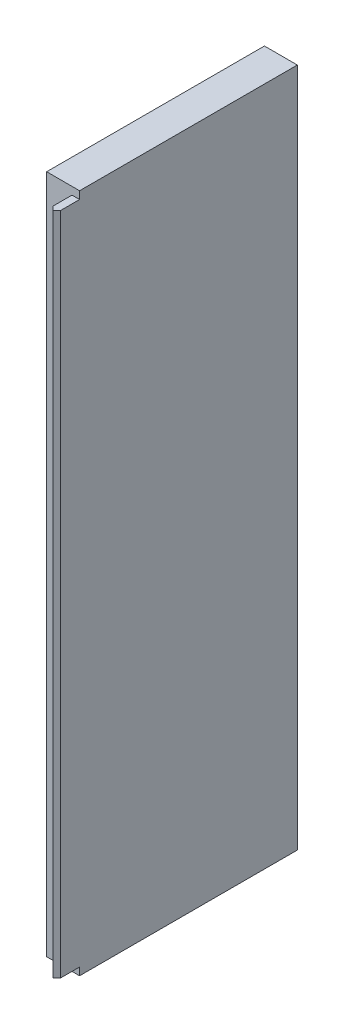
ISO-10303-21;
HEADER;
FILE_DESCRIPTION(('STEP AP214'),'2;1');
FILE_NAME('part.step','',(''),(''),'','','');
FILE_SCHEMA(('AUTOMOTIVE_DESIGN { 1 0 10303 214 1 1 1 1 }'));
ENDSEC;
DATA;
#1=APPLICATION_CONTEXT('core data for automotive mechanical design processes');
#2=APPLICATION_PROTOCOL_DEFINITION('international standard','automotive_design',2000,#1);
#3=PRODUCT_CONTEXT('',#1,'mechanical');
#4=PRODUCT('Part','Part','',(#3));
#5=PRODUCT_RELATED_PRODUCT_CATEGORY('part','',(#4));
#6=PRODUCT_DEFINITION_FORMATION('','',#4);
#7=PRODUCT_DEFINITION_CONTEXT('part definition',#1,'design');
#8=PRODUCT_DEFINITION('design','',#6,#7);
#9=PRODUCT_DEFINITION_SHAPE('','',#8);
#10=(LENGTH_UNIT() NAMED_UNIT(*) SI_UNIT(.MILLI.,.METRE.));
#11=(NAMED_UNIT(*) PLANE_ANGLE_UNIT() SI_UNIT($,.RADIAN.));
#12=(NAMED_UNIT(*) SI_UNIT($,.STERADIAN.) SOLID_ANGLE_UNIT());
#13=UNCERTAINTY_MEASURE_WITH_UNIT(LENGTH_MEASURE(1.E-05),#10,'distance_accuracy_value','');
#14=(GEOMETRIC_REPRESENTATION_CONTEXT(3) GLOBAL_UNCERTAINTY_ASSIGNED_CONTEXT((#13)) GLOBAL_UNIT_ASSIGNED_CONTEXT((#10,
#11,#12)) REPRESENTATION_CONTEXT('',''));
#15=CARTESIAN_POINT('',(0.,0.,0.));
#16=DIRECTION('',(0.,0.,1.));
#17=DIRECTION('',(1.,0.,0.));
#18=AXIS2_PLACEMENT_3D('',#15,#16,#17);
#19=CARTESIAN_POINT('',(0.,0.,0.));
#20=DIRECTION('',(0.,1.,0.));
#21=DIRECTION('',(0.,0.,1.));
#22=AXIS2_PLACEMENT_3D('',#19,#20,#21);
#23=PLANE('',#22);
#24=DIRECTION('',(0.707106781186554,0.,-0.707106781186541));
#25=VECTOR('',#24,1.);
#26=CARTESIAN_POINT('',(1.2,0.,20.2));
#27=LINE('',#26,#25);
#28=CARTESIAN_POINT('',(1.2,0.,20.2));
#29=VERTEX_POINT('',#28);
#30=CARTESIAN_POINT('',(0.600000000000002,0.,20.8));
#31=VERTEX_POINT('',#30);
#32=EDGE_CURVE('E388',#29,#31,#27,.F.);
#33=ORIENTED_EDGE('',*,*,#32,.T.);
#34=DIRECTION('',(0.707106781186543,0.,0.707106781186552));
#35=VECTOR('',#34,1.);
#36=CARTESIAN_POINT('',(0.999999999999987,0.,21.2));
#37=LINE('',#36,#35);
#38=CARTESIAN_POINT('',(0.,0.,20.2));
#39=VERTEX_POINT('',#38);
#40=EDGE_CURVE('E441',#31,#39,#37,.F.);
#41=ORIENTED_EDGE('',*,*,#40,.T.);
#42=DIRECTION('',(0.,0.,1.));
#43=VECTOR('',#42,1.);
#44=CARTESIAN_POINT('',(0.,0.,21.2));
#45=LINE('',#44,#43);
#46=CARTESIAN_POINT('',(0.,0.,17.2));
#47=VERTEX_POINT('',#46);
#48=EDGE_CURVE('E392',#47,#39,#45,.T.);
#49=ORIENTED_EDGE('',*,*,#48,.F.);
#50=DIRECTION('',(-1.,0.,0.));
#51=VECTOR('',#50,1.);
#52=CARTESIAN_POINT('',(1.2,0.,17.2));
#53=LINE('',#52,#51);
#54=CARTESIAN_POINT('',(1.2,0.,17.2));
#55=VERTEX_POINT('',#54);
#56=EDGE_CURVE('E231',#55,#47,#53,.T.);
#57=ORIENTED_EDGE('',*,*,#56,.F.);
#58=DIRECTION('',(0.,0.,-1.));
#59=VECTOR('',#58,1.);
#60=CARTESIAN_POINT('',(1.2,0.,-17.2));
#61=LINE('',#60,#59);
#62=EDGE_CURVE('E410',#29,#55,#61,.T.);
#63=ORIENTED_EDGE('',*,*,#62,.F.);
#64=EDGE_LOOP('',(#33,#41,#49,#57,#63));
#65=FACE_BOUND('',#64,.T.);
#66=ADVANCED_FACE('F33',(#65),#23,.F.);
#67=CARTESIAN_POINT('',(0.,105.,21.2));
#68=DIRECTION('',(1.,0.,0.));
#69=DIRECTION('',(0.,0.,-1.));
#70=AXIS2_PLACEMENT_3D('',#67,#68,#69);
#71=PLANE('',#70);
#72=ORIENTED_EDGE('',*,*,#48,.T.);
#73=DIRECTION('',(0.,1.,0.));
#74=VECTOR('',#73,1.);
#75=CARTESIAN_POINT('',(0.,105.,20.2));
#76=LINE('',#75,#74);
#77=CARTESIAN_POINT('',(0.,105.,20.2));
#78=VERTEX_POINT('',#77);
#79=EDGE_CURVE('E443',#39,#78,#76,.T.);
#80=ORIENTED_EDGE('',*,*,#79,.T.);
#81=DIRECTION('',(0.,0.,1.));
#82=VECTOR('',#81,1.);
#83=CARTESIAN_POINT('',(0.,105.,21.2));
#84=LINE('',#83,#82);
#85=CARTESIAN_POINT('',(0.,105.,17.2));
#86=VERTEX_POINT('',#85);
#87=EDGE_CURVE('E393',#86,#78,#84,.T.);
#88=ORIENTED_EDGE('',*,*,#87,.F.);
#89=DIRECTION('',(0.,-1.,0.));
#90=VECTOR('',#89,1.);
#91=CARTESIAN_POINT('',(0.,105.,17.2));
#92=LINE('',#91,#90);
#93=EDGE_CURVE('E407',#86,#47,#92,.T.);
#94=ORIENTED_EDGE('',*,*,#93,.T.);
#95=EDGE_LOOP('',(#72,#80,#88,#94));
#96=FACE_BOUND('',#95,.T.);
#97=ADVANCED_FACE('F450',(#96),#71,.F.);
#98=CARTESIAN_POINT('',(1.2,105.,-17.2));
#99=DIRECTION('',(-1.,0.,0.));
#100=DIRECTION('',(0.,0.,1.));
#101=AXIS2_PLACEMENT_3D('',#98,#99,#100);
#102=PLANE('',#101);
#103=DIRECTION('',(0.,0.,-1.));
#104=VECTOR('',#103,1.);
#105=CARTESIAN_POINT('',(1.2,105.,17.2));
#106=LINE('',#105,#104);
#107=CARTESIAN_POINT('',(1.2,105.,20.2));
#108=VERTEX_POINT('',#107);
#109=CARTESIAN_POINT('',(1.2,105.,17.2));
#110=VERTEX_POINT('',#109);
#111=EDGE_CURVE('E395',#108,#110,#106,.T.);
#112=ORIENTED_EDGE('',*,*,#111,.F.);
#113=DIRECTION('',(0.,-1.,0.));
#114=VECTOR('',#113,1.);
#115=CARTESIAN_POINT('',(1.2,105.,20.2));
#116=LINE('',#115,#114);
#117=EDGE_CURVE('E11',#108,#29,#116,.T.);
#118=ORIENTED_EDGE('',*,*,#117,.T.);
#119=ORIENTED_EDGE('',*,*,#62,.T.);
#120=DIRECTION('',(0.,1.,0.));
#121=VECTOR('',#120,1.);
#122=CARTESIAN_POINT('',(1.2,-1.2,17.2));
#123=LINE('',#122,#121);
#124=CARTESIAN_POINT('',(1.2,-1.2,17.2));
#125=VERTEX_POINT('',#124);
#126=EDGE_CURVE('E364',#125,#55,#123,.T.);
#127=ORIENTED_EDGE('',*,*,#126,.F.);
#128=DIRECTION('',(0.,0.,1.));
#129=VECTOR('',#128,1.);
#130=CARTESIAN_POINT('',(1.2,-1.2,-17.2));
#131=LINE('',#130,#129);
#132=CARTESIAN_POINT('',(1.2,-1.2,-17.2));
#133=VERTEX_POINT('',#132);
#134=EDGE_CURVE('E351',#133,#125,#131,.T.);
#135=ORIENTED_EDGE('',*,*,#134,.F.);
#136=DIRECTION('',(0.,-1.,0.));
#137=VECTOR('',#136,1.);
#138=CARTESIAN_POINT('',(1.2,105.,-17.2));
#139=LINE('',#138,#137);
#140=CARTESIAN_POINT('',(1.2,106.2,-17.2));
#141=VERTEX_POINT('',#140);
#142=EDGE_CURVE('E389',#141,#133,#139,.T.);
#143=ORIENTED_EDGE('',*,*,#142,.F.);
#144=DIRECTION('',(0.,0.,-1.));
#145=VECTOR('',#144,1.);
#146=CARTESIAN_POINT('',(1.2,106.2,-17.2));
#147=LINE('',#146,#145);
#148=CARTESIAN_POINT('',(1.2,106.2,17.2));
#149=VERTEX_POINT('',#148);
#150=EDGE_CURVE('E371',#149,#141,#147,.T.);
#151=ORIENTED_EDGE('',*,*,#150,.F.);
#152=DIRECTION('',(0.,-1.,0.));
#153=VECTOR('',#152,1.);
#154=CARTESIAN_POINT('',(1.2,106.2,17.2));
#155=LINE('',#154,#153);
#156=EDGE_CURVE('E382',#149,#110,#155,.T.);
#157=ORIENTED_EDGE('',*,*,#156,.T.);
#158=EDGE_LOOP('',(#112,#118,#119,#127,#135,#143,#151,#157));
#159=FACE_BOUND('',#158,.T.);
#160=ADVANCED_FACE('F469',(#159),#102,.F.);
#161=CARTESIAN_POINT('',(-4.00000000000001,105.,-17.2));
#162=DIRECTION('',(0.,0.,1.));
#163=DIRECTION('',(1.,0.,0.));
#164=AXIS2_PLACEMENT_3D('',#161,#162,#163);
#165=PLANE('',#164);
#166=ORIENTED_EDGE('',*,*,#142,.T.);
#167=DIRECTION('',(1.,0.,0.));
#168=VECTOR('',#167,1.);
#169=CARTESIAN_POINT('',(1.2,-1.2,-17.2));
#170=LINE('',#169,#168);
#171=CARTESIAN_POINT('',(-4.,-1.2,-17.2));
#172=VERTEX_POINT('',#171);
#173=EDGE_CURVE('E361',#172,#133,#170,.T.);
#174=ORIENTED_EDGE('',*,*,#173,.F.);
#175=DIRECTION('',(0.,-1.,0.));
#176=VECTOR('',#175,1.);
#177=CARTESIAN_POINT('',(-4.00000000000001,105.,-17.2));
#178=LINE('',#177,#176);
#179=CARTESIAN_POINT('',(-4.00000000000001,106.2,-17.2));
#180=VERTEX_POINT('',#179);
#181=EDGE_CURVE('E437',#180,#172,#178,.T.);
#182=ORIENTED_EDGE('',*,*,#181,.F.);
#183=DIRECTION('',(-1.,0.,0.));
#184=VECTOR('',#183,1.);
#185=CARTESIAN_POINT('',(1.2,106.2,-17.2));
#186=LINE('',#185,#184);
#187=EDGE_CURVE('E374',#141,#180,#186,.T.);
#188=ORIENTED_EDGE('',*,*,#187,.F.);
#189=EDGE_LOOP('',(#166,#174,#182,#188));
#190=FACE_BOUND('',#189,.T.);
#191=ADVANCED_FACE('F485',(#190),#165,.F.);
#192=CARTESIAN_POINT('',(0.,105.,-16.));
#193=DIRECTION('',(0.,0.,-1.));
#194=DIRECTION('',(-1.,0.,0.));
#195=AXIS2_PLACEMENT_3D('',#192,#193,#194);
#196=PLANE('',#195);
#197=DIRECTION('',(1.,0.,0.));
#198=VECTOR('',#197,1.);
#199=CARTESIAN_POINT('',(0.,0.,-16.));
#200=LINE('',#199,#198);
#201=CARTESIAN_POINT('',(-4.,0.,-16.));
#202=VERTEX_POINT('',#201);
#203=CARTESIAN_POINT('',(0.,0.,-16.));
#204=VERTEX_POINT('',#203);
#205=EDGE_CURVE('E412',#202,#204,#200,.T.);
#206=ORIENTED_EDGE('',*,*,#205,.T.);
#207=DIRECTION('',(0.,-1.,0.));
#208=VECTOR('',#207,1.);
#209=CARTESIAN_POINT('',(0.,105.,-16.));
#210=LINE('',#209,#208);
#211=CARTESIAN_POINT('',(0.,105.,-16.));
#212=VERTEX_POINT('',#211);
#213=EDGE_CURVE('E431',#212,#204,#210,.T.);
#214=ORIENTED_EDGE('',*,*,#213,.F.);
#215=DIRECTION('',(1.,0.,0.));
#216=VECTOR('',#215,1.);
#217=CARTESIAN_POINT('',(0.,105.,-16.));
#218=LINE('',#217,#216);
#219=CARTESIAN_POINT('',(-4.,105.,-16.));
#220=VERTEX_POINT('',#219);
#221=EDGE_CURVE('E398',#220,#212,#218,.T.);
#222=ORIENTED_EDGE('',*,*,#221,.F.);
#223=DIRECTION('',(0.,-1.,0.));
#224=VECTOR('',#223,1.);
#225=CARTESIAN_POINT('',(-4.,105.,-16.));
#226=LINE('',#225,#224);
#227=EDGE_CURVE('E434',#220,#202,#226,.T.);
#228=ORIENTED_EDGE('',*,*,#227,.T.);
#229=EDGE_LOOP('',(#206,#214,#222,#228));
#230=FACE_BOUND('',#229,.T.);
#231=ADVANCED_FACE('F487',(#230),#196,.F.);
#232=CARTESIAN_POINT('',(0.,105.,16.));
#233=DIRECTION('',(1.,0.,0.));
#234=DIRECTION('',(0.,0.,-1.));
#235=AXIS2_PLACEMENT_3D('',#232,#233,#234);
#236=PLANE('',#235);
#237=DIRECTION('',(0.,0.,1.));
#238=VECTOR('',#237,1.);
#239=CARTESIAN_POINT('',(0.,0.,16.));
#240=LINE('',#239,#238);
#241=CARTESIAN_POINT('',(0.,0.,-12.5));
#242=VERTEX_POINT('',#241);
#243=EDGE_CURVE('E416',#204,#242,#240,.T.);
#244=ORIENTED_EDGE('',*,*,#243,.T.);
#245=DIRECTION('',(0.,1.,0.));
#246=VECTOR('',#245,1.);
#247=CARTESIAN_POINT('',(0.,-1.201,-12.5));
#248=LINE('',#247,#246);
#249=CARTESIAN_POINT('',(0.,-1.2,-12.5));
#250=VERTEX_POINT('',#249);
#251=EDGE_CURVE('E341',#250,#242,#248,.T.);
#252=ORIENTED_EDGE('',*,*,#251,.F.);
#253=DIRECTION('',(0.,0.,-1.));
#254=VECTOR('',#253,1.);
#255=CARTESIAN_POINT('',(0.,-1.2,-9.50000000000001));
#256=LINE('',#255,#254);
#257=CARTESIAN_POINT('',(0.,-1.2,-9.50000000000001));
#258=VERTEX_POINT('',#257);
#259=EDGE_CURVE('E329',#258,#250,#256,.T.);
#260=ORIENTED_EDGE('',*,*,#259,.F.);
#261=DIRECTION('',(0.,1.,0.));
#262=VECTOR('',#261,1.);
#263=CARTESIAN_POINT('',(0.,-1.201,-9.50000000000001));
#264=LINE('',#263,#262);
#265=CARTESIAN_POINT('',(0.,0.,-9.50000000000001));
#266=VERTEX_POINT('',#265);
#267=EDGE_CURVE('E342',#258,#266,#264,.T.);
#268=ORIENTED_EDGE('',*,*,#267,.T.);
#269=CARTESIAN_POINT('',(0.,0.,-5.16666666666667));
#270=VERTEX_POINT('',#269);
#271=EDGE_CURVE('E418',#266,#270,#240,.T.);
#272=ORIENTED_EDGE('',*,*,#271,.T.);
#273=DIRECTION('',(0.,1.,0.));
#274=VECTOR('',#273,1.);
#275=CARTESIAN_POINT('',(0.,-1.201,-5.16666666666667));
#276=LINE('',#275,#274);
#277=CARTESIAN_POINT('',(0.,-1.2,-5.16666666666667));
#278=VERTEX_POINT('',#277);
#279=EDGE_CURVE('E313',#278,#270,#276,.T.);
#280=ORIENTED_EDGE('',*,*,#279,.F.);
#281=DIRECTION('',(0.,0.,-1.));
#282=VECTOR('',#281,1.);
#283=CARTESIAN_POINT('',(0.,-1.2,-2.16666666666667));
#284=LINE('',#283,#282);
#285=CARTESIAN_POINT('',(0.,-1.2,-2.16666666666667));
#286=VERTEX_POINT('',#285);
#287=EDGE_CURVE('E301',#286,#278,#284,.T.);
#288=ORIENTED_EDGE('',*,*,#287,.F.);
#289=DIRECTION('',(0.,1.,0.));
#290=VECTOR('',#289,1.);
#291=CARTESIAN_POINT('',(0.,-1.201,-2.16666666666667));
#292=LINE('',#291,#290);
#293=CARTESIAN_POINT('',(0.,0.,-2.16666666666667));
#294=VERTEX_POINT('',#293);
#295=EDGE_CURVE('E314',#286,#294,#292,.T.);
#296=ORIENTED_EDGE('',*,*,#295,.T.);
#297=CARTESIAN_POINT('',(0.,0.,2.16666666666667));
#298=VERTEX_POINT('',#297);
#299=EDGE_CURVE('E802',#294,#298,#240,.T.);
#300=ORIENTED_EDGE('',*,*,#299,.T.);
#301=DIRECTION('',(0.,1.,0.));
#302=VECTOR('',#301,1.);
#303=CARTESIAN_POINT('',(0.,-1.201,2.16666666666667));
#304=LINE('',#303,#302);
#305=CARTESIAN_POINT('',(0.,-1.2,2.16666666666667));
#306=VERTEX_POINT('',#305);
#307=EDGE_CURVE('E283',#306,#298,#304,.T.);
#308=ORIENTED_EDGE('',*,*,#307,.F.);
#309=DIRECTION('',(0.,0.,-1.));
#310=VECTOR('',#309,1.);
#311=CARTESIAN_POINT('',(0.,-1.2,5.16666666666667));
#312=LINE('',#311,#310);
#313=CARTESIAN_POINT('',(0.,-1.2,5.16666666666667));
#314=VERTEX_POINT('',#313);
#315=EDGE_CURVE('E271',#314,#306,#312,.T.);
#316=ORIENTED_EDGE('',*,*,#315,.F.);
#317=DIRECTION('',(0.,1.,0.));
#318=VECTOR('',#317,1.);
#319=CARTESIAN_POINT('',(0.,-1.201,5.16666666666667));
#320=LINE('',#319,#318);
#321=CARTESIAN_POINT('',(0.,0.,5.16666666666667));
#322=VERTEX_POINT('',#321);
#323=EDGE_CURVE('E284',#314,#322,#320,.T.);
#324=ORIENTED_EDGE('',*,*,#323,.T.);
#325=CARTESIAN_POINT('',(0.,0.,9.5));
#326=VERTEX_POINT('',#325);
#327=EDGE_CURVE('E241',#322,#326,#240,.T.);
#328=ORIENTED_EDGE('',*,*,#327,.T.);
#329=DIRECTION('',(0.,1.,0.));
#330=VECTOR('',#329,1.);
#331=CARTESIAN_POINT('',(0.,-1.201,9.50000000000001));
#332=LINE('',#331,#330);
#333=CARTESIAN_POINT('',(0.,-1.2,9.50000000000001));
#334=VERTEX_POINT('',#333);
#335=EDGE_CURVE('E224',#334,#326,#332,.T.);
#336=ORIENTED_EDGE('',*,*,#335,.F.);
#337=DIRECTION('',(0.,0.,-1.));
#338=VECTOR('',#337,1.);
#339=CARTESIAN_POINT('',(0.,-1.2,12.5));
#340=LINE('',#339,#338);
#341=CARTESIAN_POINT('',(0.,-1.2,12.5));
#342=VERTEX_POINT('',#341);
#343=EDGE_CURVE('E238',#342,#334,#340,.T.);
#344=ORIENTED_EDGE('',*,*,#343,.F.);
#345=DIRECTION('',(0.,1.,0.));
#346=VECTOR('',#345,1.);
#347=CARTESIAN_POINT('',(0.,-1.201,12.5));
#348=LINE('',#347,#346);
#349=CARTESIAN_POINT('',(0.,0.,12.5));
#350=VERTEX_POINT('',#349);
#351=EDGE_CURVE('E232',#342,#350,#348,.T.);
#352=ORIENTED_EDGE('',*,*,#351,.T.);
#353=CARTESIAN_POINT('',(0.,0.,16.));
#354=VERTEX_POINT('',#353);
#355=EDGE_CURVE('E415',#350,#354,#240,.T.);
#356=ORIENTED_EDGE('',*,*,#355,.T.);
#357=DIRECTION('',(0.,-1.,0.));
#358=VECTOR('',#357,1.);
#359=CARTESIAN_POINT('',(0.,105.,16.));
#360=LINE('',#359,#358);
#361=CARTESIAN_POINT('',(0.,105.,16.));
#362=VERTEX_POINT('',#361);
#363=EDGE_CURVE('E428',#362,#354,#360,.T.);
#364=ORIENTED_EDGE('',*,*,#363,.F.);
#365=DIRECTION('',(0.,0.,1.));
#366=VECTOR('',#365,1.);
#367=CARTESIAN_POINT('',(0.,105.,16.));
#368=LINE('',#367,#366);
#369=EDGE_CURVE('E401',#212,#362,#368,.T.);
#370=ORIENTED_EDGE('',*,*,#369,.F.);
#371=ORIENTED_EDGE('',*,*,#213,.T.);
#372=EDGE_LOOP('',(#244,#252,#260,#268,#272,#280,#288,#296,#300,#308,#316,#324,#328,#336,#344,
#352,#356,#364,#370,#371));
#373=FACE_BOUND('',#372,.T.);
#374=ADVANCED_FACE('F237',(#373),#236,.F.);
#375=CARTESIAN_POINT('',(-3.99999999999999,105.,16.));
#376=DIRECTION('',(0.,0.,1.));
#377=DIRECTION('',(1.,0.,0.));
#378=AXIS2_PLACEMENT_3D('',#375,#376,#377);
#379=PLANE('',#378);
#380=DIRECTION('',(-1.,0.,0.));
#381=VECTOR('',#380,1.);
#382=CARTESIAN_POINT('',(-3.99999999999999,0.,16.));
#383=LINE('',#382,#381);
#384=CARTESIAN_POINT('',(-4.,0.,16.));
#385=VERTEX_POINT('',#384);
#386=EDGE_CURVE('E396',#354,#385,#383,.T.);
#387=ORIENTED_EDGE('',*,*,#386,.T.);
#388=DIRECTION('',(0.,-1.,0.));
#389=VECTOR('',#388,1.);
#390=CARTESIAN_POINT('',(-3.99999999999999,105.,16.));
#391=LINE('',#390,#389);
#392=CARTESIAN_POINT('',(-3.99999999999999,105.,16.));
#393=VERTEX_POINT('',#392);
#394=EDGE_CURVE('E425',#393,#385,#391,.T.);
#395=ORIENTED_EDGE('',*,*,#394,.F.);
#396=DIRECTION('',(-1.,0.,0.));
#397=VECTOR('',#396,1.);
#398=CARTESIAN_POINT('',(-3.99999999999999,105.,16.));
#399=LINE('',#398,#397);
#400=EDGE_CURVE('E404',#362,#393,#399,.T.);
#401=ORIENTED_EDGE('',*,*,#400,.F.);
#402=ORIENTED_EDGE('',*,*,#363,.T.);
#403=EDGE_LOOP('',(#387,#395,#401,#402));
#404=FACE_BOUND('',#403,.T.);
#405=ADVANCED_FACE('F511',(#404),#379,.F.);
#406=CARTESIAN_POINT('',(-4.,105.,17.2));
#407=DIRECTION('',(1.,0.,0.));
#408=DIRECTION('',(0.,0.,-1.));
#409=AXIS2_PLACEMENT_3D('',#406,#407,#408);
#410=PLANE('',#409);
#411=DIRECTION('',(0.,0.,-1.));
#412=VECTOR('',#411,1.);
#413=CARTESIAN_POINT('',(-4.,-1.2,-17.2));
#414=LINE('',#413,#412);
#415=CARTESIAN_POINT('',(-4.,-1.2,17.2));
#416=VERTEX_POINT('',#415);
#417=EDGE_CURVE('E358',#416,#172,#414,.T.);
#418=ORIENTED_EDGE('',*,*,#417,.F.);
#419=DIRECTION('',(0.,-1.,0.));
#420=VECTOR('',#419,1.);
#421=CARTESIAN_POINT('',(-4.,105.,17.2));
#422=LINE('',#421,#420);
#423=CARTESIAN_POINT('',(-4.,106.2,17.2));
#424=VERTEX_POINT('',#423);
#425=EDGE_CURVE('E423',#424,#416,#422,.T.);
#426=ORIENTED_EDGE('',*,*,#425,.F.);
#427=DIRECTION('',(0.,0.,1.));
#428=VECTOR('',#427,1.);
#429=CARTESIAN_POINT('',(-4.00000000000001,106.2,-17.2));
#430=LINE('',#429,#428);
#431=EDGE_CURVE('E377',#180,#424,#430,.T.);
#432=ORIENTED_EDGE('',*,*,#431,.F.);
#433=ORIENTED_EDGE('',*,*,#181,.T.);
#434=EDGE_LOOP('',(#418,#426,#432,#433));
#435=FACE_BOUND('',#434,.T.);
#436=ORIENTED_EDGE('',*,*,#394,.T.);
#437=DIRECTION('',(0.,0.,-1.));
#438=VECTOR('',#437,1.);
#439=CARTESIAN_POINT('',(-4.,0.,-17.2));
#440=LINE('',#439,#438);
#441=EDGE_CURVE('E355',#385,#202,#440,.T.);
#442=ORIENTED_EDGE('',*,*,#441,.T.);
#443=ORIENTED_EDGE('',*,*,#227,.F.);
#444=DIRECTION('',(0.,0.,1.));
#445=VECTOR('',#444,1.);
#446=CARTESIAN_POINT('',(-4.00000000000001,105.,-17.2));
#447=LINE('',#446,#445);
#448=EDGE_CURVE('E370',#220,#393,#447,.T.);
#449=ORIENTED_EDGE('',*,*,#448,.T.);
#450=EDGE_LOOP('',(#436,#442,#443,#449));
#451=FACE_BOUND('',#450,.T.);
#452=ADVANCED_FACE('F479',(#435,#451),#410,.F.);
#453=CARTESIAN_POINT('',(0.,105.,17.2));
#454=DIRECTION('',(0.,0.,-1.));
#455=DIRECTION('',(-1.,0.,0.));
#456=AXIS2_PLACEMENT_3D('',#453,#454,#455);
#457=PLANE('',#456);
#458=ORIENTED_EDGE('',*,*,#425,.T.);
#459=DIRECTION('',(-1.,0.,0.));
#460=VECTOR('',#459,1.);
#461=CARTESIAN_POINT('',(1.2,-1.2,17.2));
#462=LINE('',#461,#460);
#463=EDGE_CURVE('E354',#125,#416,#462,.T.);
#464=ORIENTED_EDGE('',*,*,#463,.F.);
#465=ORIENTED_EDGE('',*,*,#126,.T.);
#466=ORIENTED_EDGE('',*,*,#56,.T.);
#467=ORIENTED_EDGE('',*,*,#93,.F.);
#468=DIRECTION('',(1.,0.,0.));
#469=VECTOR('',#468,1.);
#470=CARTESIAN_POINT('',(1.2,105.,17.2));
#471=LINE('',#470,#469);
#472=EDGE_CURVE('E385',#86,#110,#471,.T.);
#473=ORIENTED_EDGE('',*,*,#472,.T.);
#474=ORIENTED_EDGE('',*,*,#156,.F.);
#475=DIRECTION('',(1.,0.,0.));
#476=VECTOR('',#475,1.);
#477=CARTESIAN_POINT('',(1.2,106.2,17.2));
#478=LINE('',#477,#476);
#479=EDGE_CURVE('E380',#424,#149,#478,.T.);
#480=ORIENTED_EDGE('',*,*,#479,.F.);
#481=EDGE_LOOP('',(#458,#464,#465,#466,#467,#473,#474,#480));
#482=FACE_BOUND('',#481,.T.);
#483=ADVANCED_FACE('F458',(#482),#457,.F.);
#484=CARTESIAN_POINT('',(0.,105.,0.));
#485=DIRECTION('',(0.,1.,0.));
#486=DIRECTION('',(0.,0.,1.));
#487=AXIS2_PLACEMENT_3D('',#484,#485,#486);
#488=PLANE('',#487);
#489=ORIENTED_EDGE('',*,*,#87,.T.);
#490=DIRECTION('',(-0.707106781186543,0.,-0.707106781186552));
#491=VECTOR('',#490,1.);
#492=CARTESIAN_POINT('',(-10.1,105.,10.0999999999999));
#493=LINE('',#492,#491);
#494=CARTESIAN_POINT('',(0.600000000000002,105.,20.8));
#495=VERTEX_POINT('',#494);
#496=EDGE_CURVE('E42',#78,#495,#493,.F.);
#497=ORIENTED_EDGE('',*,*,#496,.T.);
#498=DIRECTION('',(-0.707106781186554,0.,0.707106781186541));
#499=VECTOR('',#498,1.);
#500=CARTESIAN_POINT('',(10.7,105.,10.7000000000002));
#501=LINE('',#500,#499);
#502=EDGE_CURVE('E52',#495,#108,#501,.F.);
#503=ORIENTED_EDGE('',*,*,#502,.T.);
#504=ORIENTED_EDGE('',*,*,#111,.T.);
#505=ORIENTED_EDGE('',*,*,#472,.F.);
#506=EDGE_LOOP('',(#489,#497,#503,#504,#505));
#507=FACE_BOUND('',#506,.T.);
#508=ADVANCED_FACE('F454',(#507),#488,.T.);
#509=CARTESIAN_POINT('',(0.,106.2,0.));
#510=DIRECTION('',(0.,-1.,0.));
#511=DIRECTION('',(0.,0.,-1.));
#512=AXIS2_PLACEMENT_3D('',#509,#510,#511);
#513=PLANE('',#512);
#514=ORIENTED_EDGE('',*,*,#150,.T.);
#515=ORIENTED_EDGE('',*,*,#187,.T.);
#516=ORIENTED_EDGE('',*,*,#431,.T.);
#517=ORIENTED_EDGE('',*,*,#479,.T.);
#518=EDGE_LOOP('',(#514,#515,#516,#517));
#519=FACE_BOUND('',#518,.T.);
#520=ADVANCED_FACE('F474',(#519),#513,.F.);
#521=CARTESIAN_POINT('',(0.,105.,0.));
#522=DIRECTION('',(0.,-1.,0.));
#523=DIRECTION('',(0.,0.,-1.));
#524=AXIS2_PLACEMENT_3D('',#521,#522,#523);
#525=PLANE('',#524);
#526=ORIENTED_EDGE('',*,*,#448,.F.);
#527=ORIENTED_EDGE('',*,*,#221,.T.);
#528=ORIENTED_EDGE('',*,*,#369,.T.);
#529=ORIENTED_EDGE('',*,*,#400,.T.);
#530=EDGE_LOOP('',(#526,#527,#528,#529));
#531=FACE_BOUND('',#530,.T.);
#532=ADVANCED_FACE('F549',(#531),#525,.T.);
#533=CARTESIAN_POINT('',(0.,-1.2,0.));
#534=DIRECTION('',(0.,-1.,0.));
#535=DIRECTION('',(0.,0.,-1.));
#536=AXIS2_PLACEMENT_3D('',#533,#534,#535);
#537=PLANE('',#536);
#538=ORIENTED_EDGE('',*,*,#343,.T.);
#539=DIRECTION('',(-1.,0.,0.));
#540=VECTOR('',#539,1.);
#541=CARTESIAN_POINT('',(0.,-1.2,9.50000000000001));
#542=LINE('',#541,#540);
#543=CARTESIAN_POINT('',(-2.99999999999999,-1.2,9.5));
#544=VERTEX_POINT('',#543);
#545=EDGE_CURVE('E220',#334,#544,#542,.T.);
#546=ORIENTED_EDGE('',*,*,#545,.T.);
#547=DIRECTION('',(0.,0.,1.));
#548=VECTOR('',#547,1.);
#549=CARTESIAN_POINT('',(-2.99999999999999,-1.2,12.5));
#550=LINE('',#549,#548);
#551=CARTESIAN_POINT('',(-2.99999999999999,-1.2,12.5));
#552=VERTEX_POINT('',#551);
#553=EDGE_CURVE('E252',#544,#552,#550,.T.);
#554=ORIENTED_EDGE('',*,*,#553,.T.);
#555=DIRECTION('',(1.,0.,0.));
#556=VECTOR('',#555,1.);
#557=CARTESIAN_POINT('',(0.,-1.2,12.5));
#558=LINE('',#557,#556);
#559=EDGE_CURVE('E247',#552,#342,#558,.T.);
#560=ORIENTED_EDGE('',*,*,#559,.T.);
#561=EDGE_LOOP('',(#538,#546,#554,#560));
#562=FACE_BOUND('',#561,.T.);
#563=ORIENTED_EDGE('',*,*,#315,.T.);
#564=DIRECTION('',(-1.,0.,0.));
#565=VECTOR('',#564,1.);
#566=CARTESIAN_POINT('',(0.,-1.2,2.16666666666667));
#567=LINE('',#566,#565);
#568=CARTESIAN_POINT('',(-2.99999999999999,-1.2,2.16666666666667));
#569=VERTEX_POINT('',#568);
#570=EDGE_CURVE('E286',#306,#569,#567,.T.);
#571=ORIENTED_EDGE('',*,*,#570,.T.);
#572=DIRECTION('',(0.,0.,1.));
#573=VECTOR('',#572,1.);
#574=CARTESIAN_POINT('',(-2.99999999999999,-1.2,5.16666666666667));
#575=LINE('',#574,#573);
#576=CARTESIAN_POINT('',(-2.99999999999999,-1.2,5.16666666666667));
#577=VERTEX_POINT('',#576);
#578=EDGE_CURVE('E264',#569,#577,#575,.T.);
#579=ORIENTED_EDGE('',*,*,#578,.T.);
#580=DIRECTION('',(1.,0.,0.));
#581=VECTOR('',#580,1.);
#582=CARTESIAN_POINT('',(0.,-1.2,5.16666666666667));
#583=LINE('',#582,#581);
#584=EDGE_CURVE('E267',#577,#314,#583,.T.);
#585=ORIENTED_EDGE('',*,*,#584,.T.);
#586=EDGE_LOOP('',(#563,#571,#579,#585));
#587=FACE_BOUND('',#586,.T.);
#588=ORIENTED_EDGE('',*,*,#287,.T.);
#589=DIRECTION('',(-1.,0.,0.));
#590=VECTOR('',#589,1.);
#591=CARTESIAN_POINT('',(0.,-1.2,-5.16666666666667));
#592=LINE('',#591,#590);
#593=CARTESIAN_POINT('',(-2.99999999999999,-1.2,-5.16666666666667));
#594=VERTEX_POINT('',#593);
#595=EDGE_CURVE('E268',#278,#594,#592,.T.);
#596=ORIENTED_EDGE('',*,*,#595,.T.);
#597=DIRECTION('',(0.,0.,1.));
#598=VECTOR('',#597,1.);
#599=CARTESIAN_POINT('',(-2.99999999999999,-1.2,-2.16666666666667));
#600=LINE('',#599,#598);
#601=CARTESIAN_POINT('',(-2.99999999999999,-1.2,-2.16666666666667));
#602=VERTEX_POINT('',#601);
#603=EDGE_CURVE('E294',#594,#602,#600,.T.);
#604=ORIENTED_EDGE('',*,*,#603,.T.);
#605=DIRECTION('',(1.,0.,0.));
#606=VECTOR('',#605,1.);
#607=CARTESIAN_POINT('',(0.,-1.2,-2.16666666666667));
#608=LINE('',#607,#606);
#609=EDGE_CURVE('E297',#602,#286,#608,.T.);
#610=ORIENTED_EDGE('',*,*,#609,.T.);
#611=EDGE_LOOP('',(#588,#596,#604,#610));
#612=FACE_BOUND('',#611,.T.);
#613=ORIENTED_EDGE('',*,*,#259,.T.);
#614=DIRECTION('',(-1.,0.,0.));
#615=VECTOR('',#614,1.);
#616=CARTESIAN_POINT('',(0.,-1.2,-12.5));
#617=LINE('',#616,#615);
#618=CARTESIAN_POINT('',(-2.99999999999999,-1.2,-12.5));
#619=VERTEX_POINT('',#618);
#620=EDGE_CURVE('E298',#250,#619,#617,.T.);
#621=ORIENTED_EDGE('',*,*,#620,.T.);
#622=DIRECTION('',(0.,0.,1.));
#623=VECTOR('',#622,1.);
#624=CARTESIAN_POINT('',(-2.99999999999999,-1.2,-9.5));
#625=LINE('',#624,#623);
#626=CARTESIAN_POINT('',(-2.99999999999999,-1.2,-9.5));
#627=VERTEX_POINT('',#626);
#628=EDGE_CURVE('E323',#619,#627,#625,.T.);
#629=ORIENTED_EDGE('',*,*,#628,.T.);
#630=DIRECTION('',(1.,0.,0.));
#631=VECTOR('',#630,1.);
#632=CARTESIAN_POINT('',(0.,-1.2,-9.50000000000001));
#633=LINE('',#632,#631);
#634=EDGE_CURVE('E326',#627,#258,#633,.T.);
#635=ORIENTED_EDGE('',*,*,#634,.T.);
#636=EDGE_LOOP('',(#613,#621,#629,#635));
#637=FACE_BOUND('',#636,.T.);
#638=ORIENTED_EDGE('',*,*,#134,.T.);
#639=ORIENTED_EDGE('',*,*,#463,.T.);
#640=ORIENTED_EDGE('',*,*,#417,.T.);
#641=ORIENTED_EDGE('',*,*,#173,.T.);
#642=EDGE_LOOP('',(#638,#639,#640,#641));
#643=FACE_BOUND('',#642,.T.);
#644=ADVANCED_FACE('F245',(#562,#587,#612,#637,#643),#537,.T.);
#645=CARTESIAN_POINT('',(0.,0.,0.));
#646=DIRECTION('',(0.,-1.,0.));
#647=DIRECTION('',(0.,0.,-1.));
#648=AXIS2_PLACEMENT_3D('',#645,#646,#647);
#649=PLANE('',#648);
#650=ORIENTED_EDGE('',*,*,#355,.F.);
#651=DIRECTION('',(1.,0.,0.));
#652=VECTOR('',#651,1.);
#653=CARTESIAN_POINT('',(0.,0.,12.5));
#654=LINE('',#653,#652);
#655=CARTESIAN_POINT('',(-2.99999999999999,0.,12.5));
#656=VERTEX_POINT('',#655);
#657=EDGE_CURVE('E242',#656,#350,#654,.T.);
#658=ORIENTED_EDGE('',*,*,#657,.F.);
#659=DIRECTION('',(0.,0.,1.));
#660=VECTOR('',#659,1.);
#661=CARTESIAN_POINT('',(-2.99999999999999,0.,12.5));
#662=LINE('',#661,#660);
#663=CARTESIAN_POINT('',(-2.99999999999999,0.,9.5));
#664=VERTEX_POINT('',#663);
#665=EDGE_CURVE('E250',#664,#656,#662,.T.);
#666=ORIENTED_EDGE('',*,*,#665,.F.);
#667=DIRECTION('',(-1.,0.,0.));
#668=VECTOR('',#667,1.);
#669=CARTESIAN_POINT('',(0.,0.,9.50000000000001));
#670=LINE('',#669,#668);
#671=EDGE_CURVE('E248',#326,#664,#670,.T.);
#672=ORIENTED_EDGE('',*,*,#671,.F.);
#673=ORIENTED_EDGE('',*,*,#327,.F.);
#674=DIRECTION('',(1.,0.,0.));
#675=VECTOR('',#674,1.);
#676=CARTESIAN_POINT('',(0.,0.,5.16666666666667));
#677=LINE('',#676,#675);
#678=CARTESIAN_POINT('',(-2.99999999999999,0.,5.16666666666667));
#679=VERTEX_POINT('',#678);
#680=EDGE_CURVE('E280',#679,#322,#677,.T.);
#681=ORIENTED_EDGE('',*,*,#680,.F.);
#682=DIRECTION('',(0.,0.,1.));
#683=VECTOR('',#682,1.);
#684=CARTESIAN_POINT('',(-2.99999999999999,0.,5.16666666666667));
#685=LINE('',#684,#683);
#686=CARTESIAN_POINT('',(-2.99999999999999,0.,2.16666666666667));
#687=VERTEX_POINT('',#686);
#688=EDGE_CURVE('E277',#687,#679,#685,.T.);
#689=ORIENTED_EDGE('',*,*,#688,.F.);
#690=DIRECTION('',(-1.,0.,0.));
#691=VECTOR('',#690,1.);
#692=CARTESIAN_POINT('',(0.,0.,2.16666666666667));
#693=LINE('',#692,#691);
#694=EDGE_CURVE('E274',#298,#687,#693,.T.);
#695=ORIENTED_EDGE('',*,*,#694,.F.);
#696=ORIENTED_EDGE('',*,*,#299,.F.);
#697=DIRECTION('',(1.,0.,0.));
#698=VECTOR('',#697,1.);
#699=CARTESIAN_POINT('',(0.,0.,-2.16666666666667));
#700=LINE('',#699,#698);
#701=CARTESIAN_POINT('',(-2.99999999999999,0.,-2.16666666666667));
#702=VERTEX_POINT('',#701);
#703=EDGE_CURVE('E310',#702,#294,#700,.T.);
#704=ORIENTED_EDGE('',*,*,#703,.F.);
#705=DIRECTION('',(0.,0.,1.));
#706=VECTOR('',#705,1.);
#707=CARTESIAN_POINT('',(-2.99999999999999,0.,-2.16666666666667));
#708=LINE('',#707,#706);
#709=CARTESIAN_POINT('',(-2.99999999999999,0.,-5.16666666666667));
#710=VERTEX_POINT('',#709);
#711=EDGE_CURVE('E307',#710,#702,#708,.T.);
#712=ORIENTED_EDGE('',*,*,#711,.F.);
#713=DIRECTION('',(-1.,0.,0.));
#714=VECTOR('',#713,1.);
#715=CARTESIAN_POINT('',(0.,0.,-5.16666666666667));
#716=LINE('',#715,#714);
#717=EDGE_CURVE('E304',#270,#710,#716,.T.);
#718=ORIENTED_EDGE('',*,*,#717,.F.);
#719=ORIENTED_EDGE('',*,*,#271,.F.);
#720=DIRECTION('',(1.,0.,0.));
#721=VECTOR('',#720,1.);
#722=CARTESIAN_POINT('',(0.,0.,-9.50000000000001));
#723=LINE('',#722,#721);
#724=CARTESIAN_POINT('',(-2.99999999999999,0.,-9.5));
#725=VERTEX_POINT('',#724);
#726=EDGE_CURVE('E338',#725,#266,#723,.T.);
#727=ORIENTED_EDGE('',*,*,#726,.F.);
#728=DIRECTION('',(0.,0.,1.));
#729=VECTOR('',#728,1.);
#730=CARTESIAN_POINT('',(-2.99999999999999,0.,-9.5));
#731=LINE('',#730,#729);
#732=CARTESIAN_POINT('',(-2.99999999999999,0.,-12.5));
#733=VERTEX_POINT('',#732);
#734=EDGE_CURVE('E335',#733,#725,#731,.T.);
#735=ORIENTED_EDGE('',*,*,#734,.F.);
#736=DIRECTION('',(-1.,0.,0.));
#737=VECTOR('',#736,1.);
#738=CARTESIAN_POINT('',(0.,0.,-12.5));
#739=LINE('',#738,#737);
#740=EDGE_CURVE('E332',#242,#733,#739,.T.);
#741=ORIENTED_EDGE('',*,*,#740,.F.);
#742=ORIENTED_EDGE('',*,*,#243,.F.);
#743=ORIENTED_EDGE('',*,*,#205,.F.);
#744=ORIENTED_EDGE('',*,*,#441,.F.);
#745=ORIENTED_EDGE('',*,*,#386,.F.);
#746=EDGE_LOOP('',(#650,#658,#666,#672,#673,#681,#689,#695,#696,#704,#712,#718,#719,#727,#735,
#741,#742,#743,#744,#745));
#747=FACE_BOUND('',#746,.T.);
#748=ADVANCED_FACE('F561',(#747),#649,.F.);
#749=CARTESIAN_POINT('',(0.,-1.201,-9.50000000000001));
#750=DIRECTION('',(0.,0.,1.));
#751=DIRECTION('',(1.,0.,0.));
#752=AXIS2_PLACEMENT_3D('',#749,#750,#751);
#753=PLANE('',#752);
#754=DIRECTION('',(0.,1.,0.));
#755=VECTOR('',#754,1.);
#756=CARTESIAN_POINT('',(-2.99999999999999,-1.201,-9.5));
#757=LINE('',#756,#755);
#758=EDGE_CURVE('E344',#627,#725,#757,.T.);
#759=ORIENTED_EDGE('',*,*,#758,.T.);
#760=ORIENTED_EDGE('',*,*,#726,.T.);
#761=ORIENTED_EDGE('',*,*,#267,.F.);
#762=ORIENTED_EDGE('',*,*,#634,.F.);
#763=EDGE_LOOP('',(#759,#760,#761,#762));
#764=FACE_BOUND('',#763,.T.);
#765=ADVANCED_FACE('F568',(#764),#753,.F.);
#766=CARTESIAN_POINT('',(-2.99999999999999,-1.201,-9.5));
#767=DIRECTION('',(-1.,0.,0.));
#768=DIRECTION('',(0.,0.,1.));
#769=AXIS2_PLACEMENT_3D('',#766,#767,#768);
#770=PLANE('',#769);
#771=DIRECTION('',(0.,1.,0.));
#772=VECTOR('',#771,1.);
#773=CARTESIAN_POINT('',(-2.99999999999999,-1.201,-12.5));
#774=LINE('',#773,#772);
#775=EDGE_CURVE('E346',#619,#733,#774,.T.);
#776=ORIENTED_EDGE('',*,*,#775,.T.);
#777=ORIENTED_EDGE('',*,*,#734,.T.);
#778=ORIENTED_EDGE('',*,*,#758,.F.);
#779=ORIENTED_EDGE('',*,*,#628,.F.);
#780=EDGE_LOOP('',(#776,#777,#778,#779));
#781=FACE_BOUND('',#780,.T.);
#782=ADVANCED_FACE('F576',(#781),#770,.F.);
#783=CARTESIAN_POINT('',(0.,-1.201,-12.5));
#784=DIRECTION('',(0.,0.,-1.));
#785=DIRECTION('',(-1.,0.,0.));
#786=AXIS2_PLACEMENT_3D('',#783,#784,#785);
#787=PLANE('',#786);
#788=ORIENTED_EDGE('',*,*,#251,.T.);
#789=ORIENTED_EDGE('',*,*,#740,.T.);
#790=ORIENTED_EDGE('',*,*,#775,.F.);
#791=ORIENTED_EDGE('',*,*,#620,.F.);
#792=EDGE_LOOP('',(#788,#789,#790,#791));
#793=FACE_BOUND('',#792,.T.);
#794=ADVANCED_FACE('F584',(#793),#787,.F.);
#795=CARTESIAN_POINT('',(0.,-1.201,-2.16666666666667));
#796=DIRECTION('',(0.,0.,1.));
#797=DIRECTION('',(1.,0.,0.));
#798=AXIS2_PLACEMENT_3D('',#795,#796,#797);
#799=PLANE('',#798);
#800=DIRECTION('',(0.,1.,0.));
#801=VECTOR('',#800,1.);
#802=CARTESIAN_POINT('',(-2.99999999999999,-1.201,-2.16666666666667));
#803=LINE('',#802,#801);
#804=EDGE_CURVE('E316',#602,#702,#803,.T.);
#805=ORIENTED_EDGE('',*,*,#804,.T.);
#806=ORIENTED_EDGE('',*,*,#703,.T.);
#807=ORIENTED_EDGE('',*,*,#295,.F.);
#808=ORIENTED_EDGE('',*,*,#609,.F.);
#809=EDGE_LOOP('',(#805,#806,#807,#808));
#810=FACE_BOUND('',#809,.T.);
#811=ADVANCED_FACE('F592',(#810),#799,.F.);
#812=CARTESIAN_POINT('',(-2.99999999999999,-1.201,-2.16666666666667));
#813=DIRECTION('',(-1.,0.,0.));
#814=DIRECTION('',(0.,0.,1.));
#815=AXIS2_PLACEMENT_3D('',#812,#813,#814);
#816=PLANE('',#815);
#817=DIRECTION('',(0.,1.,0.));
#818=VECTOR('',#817,1.);
#819=CARTESIAN_POINT('',(-2.99999999999999,-1.201,-5.16666666666667));
#820=LINE('',#819,#818);
#821=EDGE_CURVE('E318',#594,#710,#820,.T.);
#822=ORIENTED_EDGE('',*,*,#821,.T.);
#823=ORIENTED_EDGE('',*,*,#711,.T.);
#824=ORIENTED_EDGE('',*,*,#804,.F.);
#825=ORIENTED_EDGE('',*,*,#603,.F.);
#826=EDGE_LOOP('',(#822,#823,#824,#825));
#827=FACE_BOUND('',#826,.T.);
#828=ADVANCED_FACE('F600',(#827),#816,.F.);
#829=CARTESIAN_POINT('',(0.,-1.201,-5.16666666666667));
#830=DIRECTION('',(0.,0.,-1.));
#831=DIRECTION('',(-1.,0.,0.));
#832=AXIS2_PLACEMENT_3D('',#829,#830,#831);
#833=PLANE('',#832);
#834=ORIENTED_EDGE('',*,*,#279,.T.);
#835=ORIENTED_EDGE('',*,*,#717,.T.);
#836=ORIENTED_EDGE('',*,*,#821,.F.);
#837=ORIENTED_EDGE('',*,*,#595,.F.);
#838=EDGE_LOOP('',(#834,#835,#836,#837));
#839=FACE_BOUND('',#838,.T.);
#840=ADVANCED_FACE('F608',(#839),#833,.F.);
#841=CARTESIAN_POINT('',(0.,-1.201,5.16666666666667));
#842=DIRECTION('',(0.,0.,1.));
#843=DIRECTION('',(1.,0.,0.));
#844=AXIS2_PLACEMENT_3D('',#841,#842,#843);
#845=PLANE('',#844);
#846=DIRECTION('',(0.,1.,0.));
#847=VECTOR('',#846,1.);
#848=CARTESIAN_POINT('',(-2.99999999999999,-1.201,5.16666666666667));
#849=LINE('',#848,#847);
#850=EDGE_CURVE('E287',#577,#679,#849,.T.);
#851=ORIENTED_EDGE('',*,*,#850,.T.);
#852=ORIENTED_EDGE('',*,*,#680,.T.);
#853=ORIENTED_EDGE('',*,*,#323,.F.);
#854=ORIENTED_EDGE('',*,*,#584,.F.);
#855=EDGE_LOOP('',(#851,#852,#853,#854));
#856=FACE_BOUND('',#855,.T.);
#857=ADVANCED_FACE('F616',(#856),#845,.F.);
#858=CARTESIAN_POINT('',(-2.99999999999999,-1.201,5.16666666666667));
#859=DIRECTION('',(-1.,0.,0.));
#860=DIRECTION('',(0.,0.,1.));
#861=AXIS2_PLACEMENT_3D('',#858,#859,#860);
#862=PLANE('',#861);
#863=DIRECTION('',(0.,1.,0.));
#864=VECTOR('',#863,1.);
#865=CARTESIAN_POINT('',(-2.99999999999999,-1.201,2.16666666666667));
#866=LINE('',#865,#864);
#867=EDGE_CURVE('E289',#569,#687,#866,.T.);
#868=ORIENTED_EDGE('',*,*,#867,.T.);
#869=ORIENTED_EDGE('',*,*,#688,.T.);
#870=ORIENTED_EDGE('',*,*,#850,.F.);
#871=ORIENTED_EDGE('',*,*,#578,.F.);
#872=EDGE_LOOP('',(#868,#869,#870,#871));
#873=FACE_BOUND('',#872,.T.);
#874=ADVANCED_FACE('F624',(#873),#862,.F.);
#875=CARTESIAN_POINT('',(0.,-1.201,2.16666666666667));
#876=DIRECTION('',(0.,0.,-1.));
#877=DIRECTION('',(-1.,0.,0.));
#878=AXIS2_PLACEMENT_3D('',#875,#876,#877);
#879=PLANE('',#878);
#880=ORIENTED_EDGE('',*,*,#307,.T.);
#881=ORIENTED_EDGE('',*,*,#694,.T.);
#882=ORIENTED_EDGE('',*,*,#867,.F.);
#883=ORIENTED_EDGE('',*,*,#570,.F.);
#884=EDGE_LOOP('',(#880,#881,#882,#883));
#885=FACE_BOUND('',#884,.T.);
#886=ADVANCED_FACE('F632',(#885),#879,.F.);
#887=CARTESIAN_POINT('',(0.,-1.201,12.5));
#888=DIRECTION('',(0.,0.,1.));
#889=DIRECTION('',(1.,0.,0.));
#890=AXIS2_PLACEMENT_3D('',#887,#888,#889);
#891=PLANE('',#890);
#892=DIRECTION('',(0.,1.,0.));
#893=VECTOR('',#892,1.);
#894=CARTESIAN_POINT('',(-2.99999999999999,-1.201,12.5));
#895=LINE('',#894,#893);
#896=EDGE_CURVE('E261',#552,#656,#895,.T.);
#897=ORIENTED_EDGE('',*,*,#896,.T.);
#898=ORIENTED_EDGE('',*,*,#657,.T.);
#899=ORIENTED_EDGE('',*,*,#351,.F.);
#900=ORIENTED_EDGE('',*,*,#559,.F.);
#901=EDGE_LOOP('',(#897,#898,#899,#900));
#902=FACE_BOUND('',#901,.T.);
#903=ADVANCED_FACE('F640',(#902),#891,.F.);
#904=CARTESIAN_POINT('',(-2.99999999999999,-1.201,12.5));
#905=DIRECTION('',(-1.,0.,0.));
#906=DIRECTION('',(0.,0.,1.));
#907=AXIS2_PLACEMENT_3D('',#904,#905,#906);
#908=PLANE('',#907);
#909=DIRECTION('',(0.,1.,0.));
#910=VECTOR('',#909,1.);
#911=CARTESIAN_POINT('',(-2.99999999999999,-1.201,9.5));
#912=LINE('',#911,#910);
#913=EDGE_CURVE('E226',#544,#664,#912,.T.);
#914=ORIENTED_EDGE('',*,*,#913,.T.);
#915=ORIENTED_EDGE('',*,*,#665,.T.);
#916=ORIENTED_EDGE('',*,*,#896,.F.);
#917=ORIENTED_EDGE('',*,*,#553,.F.);
#918=EDGE_LOOP('',(#914,#915,#916,#917));
#919=FACE_BOUND('',#918,.T.);
#920=ADVANCED_FACE('F648',(#919),#908,.F.);
#921=CARTESIAN_POINT('',(0.,-1.201,9.50000000000001));
#922=DIRECTION('',(0.,0.,-1.));
#923=DIRECTION('',(-1.,0.,0.));
#924=AXIS2_PLACEMENT_3D('',#921,#922,#923);
#925=PLANE('',#924);
#926=ORIENTED_EDGE('',*,*,#335,.T.);
#927=ORIENTED_EDGE('',*,*,#671,.T.);
#928=ORIENTED_EDGE('',*,*,#913,.F.);
#929=ORIENTED_EDGE('',*,*,#545,.F.);
#930=EDGE_LOOP('',(#926,#927,#928,#929));
#931=FACE_BOUND('',#930,.T.);
#932=ADVANCED_FACE('F222',(#931),#925,.F.);
#933=CARTESIAN_POINT('',(1.2,105.,20.2));
#934=DIRECTION('',(-0.707106781186541,0.,-0.707106781186554));
#935=DIRECTION('',(0.,-1.,0.));
#936=AXIS2_PLACEMENT_3D('',#933,#934,#935);
#937=PLANE('',#936);
#938=ORIENTED_EDGE('',*,*,#117,.F.);
#939=ORIENTED_EDGE('',*,*,#502,.F.);
#940=DIRECTION('',(0.,1.,0.));
#941=VECTOR('',#940,1.);
#942=CARTESIAN_POINT('',(0.600000000000002,105.,20.8));
#943=LINE('',#942,#941);
#944=EDGE_CURVE('E37',#31,#495,#943,.T.);
#945=ORIENTED_EDGE('',*,*,#944,.F.);
#946=ORIENTED_EDGE('',*,*,#32,.F.);
#947=EDGE_LOOP('',(#938,#939,#945,#946));
#948=FACE_BOUND('',#947,.T.);
#949=ADVANCED_FACE('F35',(#948),#937,.F.);
#950=CARTESIAN_POINT('',(0.999999999999987,105.,21.2));
#951=DIRECTION('',(0.707106781186552,0.,-0.707106781186543));
#952=DIRECTION('',(0.,-1.,0.));
#953=AXIS2_PLACEMENT_3D('',#950,#951,#952);
#954=PLANE('',#953);
#955=ORIENTED_EDGE('',*,*,#496,.F.);
#956=ORIENTED_EDGE('',*,*,#79,.F.);
#957=ORIENTED_EDGE('',*,*,#40,.F.);
#958=ORIENTED_EDGE('',*,*,#944,.T.);
#959=EDGE_LOOP('',(#955,#956,#957,#958));
#960=FACE_BOUND('',#959,.T.);
#961=ADVANCED_FACE('F465',(#960),#954,.F.);
#962=CLOSED_SHELL('',(#66,#97,#160,#191,#231,#374,#405,#452,#483,#508,#520,#532,#644,#748,#765,
#782,#794,#811,#828,#840,#857,#874,#886,#903,#920,#932,#949,#961));
#963=MANIFOLD_SOLID_BREP('B2',#962);
#964=ADVANCED_BREP_SHAPE_REPRESENTATION('',(#18,#963),#14);
#965=SHAPE_DEFINITION_REPRESENTATION(#9,#964);
ENDSEC;
END-ISO-10303-21;
